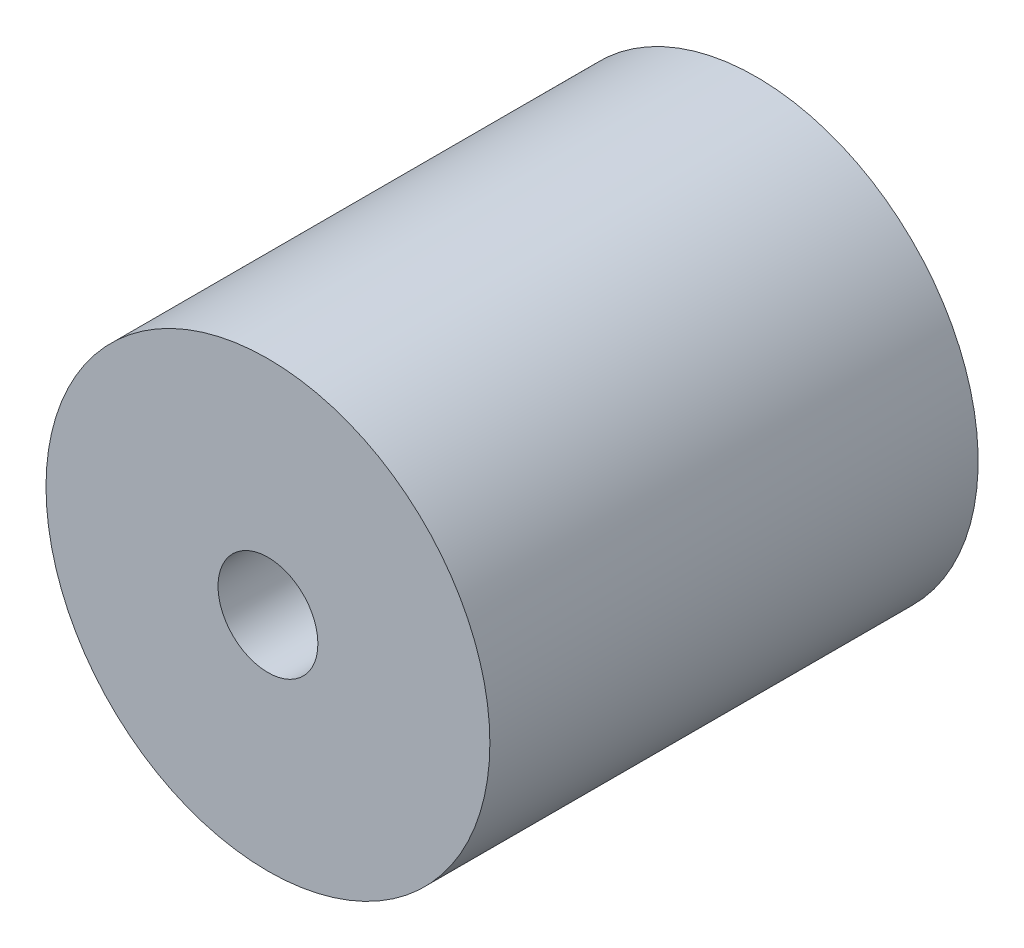
ISO-10303-21;
HEADER;
FILE_DESCRIPTION(('STEP AP214'),'2;1');
FILE_NAME('part.step','',(''),(''),'','','');
FILE_SCHEMA(('AUTOMOTIVE_DESIGN { 1 0 10303 214 1 1 1 1 }'));
ENDSEC;
DATA;
#1=APPLICATION_CONTEXT('core data for automotive mechanical design processes');
#2=APPLICATION_PROTOCOL_DEFINITION('international standard','automotive_design',2000,#1);
#3=PRODUCT_CONTEXT('',#1,'mechanical');
#4=PRODUCT('Part','Part','',(#3));
#5=PRODUCT_RELATED_PRODUCT_CATEGORY('part','',(#4));
#6=PRODUCT_DEFINITION_FORMATION('','',#4);
#7=PRODUCT_DEFINITION_CONTEXT('part definition',#1,'design');
#8=PRODUCT_DEFINITION('design','',#6,#7);
#9=PRODUCT_DEFINITION_SHAPE('','',#8);
#10=(LENGTH_UNIT() NAMED_UNIT(*) SI_UNIT(.MILLI.,.METRE.));
#11=(NAMED_UNIT(*) PLANE_ANGLE_UNIT() SI_UNIT($,.RADIAN.));
#12=(NAMED_UNIT(*) SI_UNIT($,.STERADIAN.) SOLID_ANGLE_UNIT());
#13=UNCERTAINTY_MEASURE_WITH_UNIT(LENGTH_MEASURE(1.E-05),#10,'distance_accuracy_value','');
#14=(GEOMETRIC_REPRESENTATION_CONTEXT(3) GLOBAL_UNCERTAINTY_ASSIGNED_CONTEXT((#13)) GLOBAL_UNIT_ASSIGNED_CONTEXT((#10,
#11,#12)) REPRESENTATION_CONTEXT('',''));
#15=CARTESIAN_POINT('',(0.,0.,0.));
#16=DIRECTION('',(0.,0.,1.));
#17=DIRECTION('',(1.,0.,0.));
#18=AXIS2_PLACEMENT_3D('',#15,#16,#17);
#19=CARTESIAN_POINT('',(0.,0.,0.));
#20=DIRECTION('',(0.,0.,1.));
#21=DIRECTION('',(1.,0.,0.));
#22=AXIS2_PLACEMENT_3D('',#19,#20,#21);
#23=PLANE('',#22);
#24=CARTESIAN_POINT('',(0.,0.,0.));
#25=DIRECTION('',(0.,0.,1.));
#26=DIRECTION('',(1.,0.,0.));
#27=AXIS2_PLACEMENT_3D('',#24,#25,#26);
#28=CIRCLE('',#27,2.25);
#29=CARTESIAN_POINT('',(2.25,0.,0.));
#30=VERTEX_POINT('',#29);
#31=EDGE_CURVE('E48',#30,#30,#28,.T.);
#32=ORIENTED_EDGE('',*,*,#31,.T.);
#33=EDGE_LOOP('',(#32));
#34=FACE_BOUND('',#33,.T.);
#35=CARTESIAN_POINT('',(0.,0.,0.));
#36=DIRECTION('',(0.,0.,-1.));
#37=DIRECTION('',(-1.,0.,0.));
#38=AXIS2_PLACEMENT_3D('',#35,#36,#37);
#39=CIRCLE('',#38,3.7);
#40=CARTESIAN_POINT('',(-3.7,0.,0.));
#41=VERTEX_POINT('',#40);
#42=EDGE_CURVE('E118',#41,#41,#39,.T.);
#43=ORIENTED_EDGE('',*,*,#42,.T.);
#44=EDGE_LOOP('',(#43));
#45=FACE_BOUND('',#44,.T.);
#46=ADVANCED_FACE('F31',(#34,#45),#23,.F.);
#47=CARTESIAN_POINT('',(0.,0.,15.));
#48=DIRECTION('',(0.,0.,1.));
#49=DIRECTION('',(1.,0.,0.));
#50=AXIS2_PLACEMENT_3D('',#47,#48,#49);
#51=PLANE('',#50);
#52=CARTESIAN_POINT('',(0.,0.,15.));
#53=DIRECTION('',(0.,0.,1.));
#54=DIRECTION('',(1.,0.,0.));
#55=AXIS2_PLACEMENT_3D('',#52,#53,#54);
#56=CIRCLE('',#55,10.);
#57=CARTESIAN_POINT('',(10.,0.,15.));
#58=VERTEX_POINT('',#57);
#59=EDGE_CURVE('E10',#58,#58,#56,.T.);
#60=ORIENTED_EDGE('',*,*,#59,.T.);
#61=EDGE_LOOP('',(#60));
#62=FACE_BOUND('',#61,.T.);
#63=CARTESIAN_POINT('',(0.,0.,15.));
#64=DIRECTION('',(0.,0.,1.));
#65=DIRECTION('',(1.,0.,0.));
#66=AXIS2_PLACEMENT_3D('',#63,#64,#65);
#67=CIRCLE('',#66,2.25);
#68=CARTESIAN_POINT('',(2.25,0.,15.));
#69=VERTEX_POINT('',#68);
#70=EDGE_CURVE('E44',#69,#69,#67,.T.);
#71=ORIENTED_EDGE('',*,*,#70,.F.);
#72=EDGE_LOOP('',(#71));
#73=FACE_BOUND('',#72,.T.);
#74=ADVANCED_FACE('F73',(#62,#73),#51,.T.);
#75=CARTESIAN_POINT('',(0.,0.,15.));
#76=DIRECTION('',(0.,0.,-1.));
#77=DIRECTION('',(-1.,0.,0.));
#78=AXIS2_PLACEMENT_3D('',#75,#76,#77);
#79=CYLINDRICAL_SURFACE('',#78,10.);
#80=CARTESIAN_POINT('',(-10.,0.,5.5));
#81=CARTESIAN_POINT('',(-9.99999795161742,0.111153813585267,5.50000408899669));
#82=CARTESIAN_POINT('',(-9.99812770356462,0.222359320403045,5.50929768593529));
#83=CARTESIAN_POINT('',(-9.99084731246463,0.441627015378039,5.54619700023049));
#84=CARTESIAN_POINT('',(-9.98543435720372,0.549686635082712,5.57381726560302));
#85=CARTESIAN_POINT('',(-9.97167298556573,0.759460610526626,5.64648254724158));
#86=CARTESIAN_POINT('',(-9.96332738153436,0.861180935866269,5.69151087368938));
#87=CARTESIAN_POINT('',(-9.94460796070629,1.05561597772845,5.79766449502259));
#88=CARTESIAN_POINT('',(-9.93423426471414,1.14833123015162,5.85878883121441));
#89=CARTESIAN_POINT('',(-9.9124433065994,1.32338695462973,5.99627698858287));
#90=CARTESIAN_POINT('',(-9.90101491008695,1.40558790231705,6.0728167107824));
#91=CARTESIAN_POINT('',(-9.87848360905177,1.55607351321606,6.23858483278341));
#92=CARTESIAN_POINT('',(-9.86738073000847,1.62435708954085,6.32781422267024));
#93=CARTESIAN_POINT('',(-9.8466488362523,1.74566350669524,6.51743238602375));
#94=CARTESIAN_POINT('',(-9.83703414729892,1.79854187773173,6.61791528759272));
#95=CARTESIAN_POINT('',(-9.82052536116836,1.88661133316062,6.82656363800816));
#96=CARTESIAN_POINT('',(-9.81363099523923,1.92180416487448,6.93472832669269));
#97=CARTESIAN_POINT('',(-9.80345610504409,1.97305059976966,7.15416872781583));
#98=CARTESIAN_POINT('',(-9.80012940214375,1.98934899591755,7.26538508828445));
#99=CARTESIAN_POINT('',(-9.79732750121254,2.00310425545224,7.48901964272869));
#100=CARTESIAN_POINT('',(-9.79785190935681,2.000563045427,7.60143771264029));
#101=CARTESIAN_POINT('',(-9.80265102296369,1.97690914620364,7.82249357604201));
#102=CARTESIAN_POINT('',(-9.80686905717527,1.95607708048781,7.93116281125463));
#103=CARTESIAN_POINT('',(-9.81849092320002,1.8968757692461,8.143432153326));
#104=CARTESIAN_POINT('',(-9.82589490715558,1.85850568620136,8.24703201783801));
#105=CARTESIAN_POINT('',(-9.84311237000816,1.76504956734944,8.4470305234072));
#106=CARTESIAN_POINT('',(-9.85294179627409,1.70985230246423,8.54337575913834));
#107=CARTESIAN_POINT('',(-9.87389237546124,1.58438714914536,8.72554169994562));
#108=CARTESIAN_POINT('',(-9.88501367676732,1.51411752871366,8.81136119370231));
#109=CARTESIAN_POINT('',(-9.90754042482924,1.35899986912117,8.97165880491387));
#110=CARTESIAN_POINT('',(-9.9189473842181,1.27391232242489,9.04590513571826));
#111=CARTESIAN_POINT('',(-9.94057697428817,1.09237004812402,9.17910769260245));
#112=CARTESIAN_POINT('',(-9.95079958977947,0.995915174758778,9.23806372258716));
#113=CARTESIAN_POINT('',(-9.96893380321774,0.794118773757841,9.33905501845195));
#114=CARTESIAN_POINT('',(-9.97684177696544,0.6887636391706,9.38106378728907));
#115=CARTESIAN_POINT('',(-9.98942817975716,0.472297952897329,9.44672094807713));
#116=CARTESIAN_POINT('',(-9.99410700001063,0.361188100144898,9.47037156414726));
#117=CARTESIAN_POINT('',(-9.99965343733736,0.1383588112543,9.49831290758855));
#118=CARTESIAN_POINT('',(-10.0005834930494,0.0266806566511518,9.50292083908054));
#119=CARTESIAN_POINT('',(-9.99870103860205,-0.195849868385429,9.49350028211564));
#120=CARTESIAN_POINT('',(-9.99588873882892,-0.306702284887587,9.47947284129481));
#121=CARTESIAN_POINT('',(-9.98687664016035,-0.523411319893082,9.43344325291209));
#122=CARTESIAN_POINT('',(-9.98070752808413,-0.629303896679806,9.40160386300419));
#123=CARTESIAN_POINT('',(-9.96567104122065,-0.834247254999335,9.32103203468838));
#124=CARTESIAN_POINT('',(-9.95680346428453,-0.933297523275079,9.27229833064634));
#125=CARTESIAN_POINT('',(-9.93719823066589,-1.12308234737244,9.15863501869737));
#126=CARTESIAN_POINT('',(-9.92643900874103,-1.21370025350438,9.09351443792211));
#127=CARTESIAN_POINT('',(-9.90429469659765,-1.38283603823841,8.94918161758544));
#128=CARTESIAN_POINT('',(-9.89290953936776,-1.46135261786153,8.86996786720027));
#129=CARTESIAN_POINT('',(-9.8705860711393,-1.60528118154835,8.69825329621775));
#130=CARTESIAN_POINT('',(-9.85965720466609,-1.67047540489731,8.60556851155732));
#131=CARTESIAN_POINT('',(-9.83968383592389,-1.78437084010241,8.41037727728664));
#132=CARTESIAN_POINT('',(-9.83063925826685,-1.83307271184581,8.3078712208529));
#133=CARTESIAN_POINT('',(-9.81553481168766,-1.91230368316392,8.0964635077009));
#134=CARTESIAN_POINT('',(-9.80945949744373,-1.9429269995821,7.98759831757936));
#135=CARTESIAN_POINT('',(-9.8009487358405,-1.98541730325439,7.76613309301819));
#136=CARTESIAN_POINT('',(-9.79851281382223,-1.99728673645022,7.65353354758131));
#137=CARTESIAN_POINT('',(-9.79758299262758,-2.00184182173494,7.42998227091136));
#138=CARTESIAN_POINT('',(-9.79901838378602,-1.99487157614179,7.31903770214598));
#139=CARTESIAN_POINT('',(-9.80551146969228,-1.96270460820012,7.09993670018995));
#140=CARTESIAN_POINT('',(-9.81056913534338,-1.9375080322586,6.99178024461039));
#141=CARTESIAN_POINT('',(-9.82370528438317,-1.86975713699791,6.78154457751891));
#142=CARTESIAN_POINT('',(-9.83177642037661,-1.82724501343469,6.67945127899517));
#143=CARTESIAN_POINT('',(-9.85003429948341,-1.72610928920321,6.48379255853112));
#144=CARTESIAN_POINT('',(-9.86022121997788,-1.66748433754976,6.39022785254972));
#145=CARTESIAN_POINT('',(-9.88177921046451,-1.53461182957283,6.21256885569937));
#146=CARTESIAN_POINT('',(-9.89316745819399,-1.46011577447036,6.12866246946481));
#147=CARTESIAN_POINT('',(-9.91572163743909,-1.29812873802628,5.97442758894166));
#148=CARTESIAN_POINT('',(-9.92688751726369,-1.21063477430667,5.90410221936546));
#149=CARTESIAN_POINT('',(-9.94787664775943,-1.02403525817649,5.77833071210711));
#150=CARTESIAN_POINT('',(-9.95768462438492,-0.924817768859669,5.72304799343995));
#151=CARTESIAN_POINT('',(-9.9747025017,-0.718332721881465,5.63002775480682));
#152=CARTESIAN_POINT('',(-9.98191474277232,-0.611072521726252,5.59227442093501));
#153=CARTESIAN_POINT('',(-9.99152745190741,-0.419642977847559,5.54269610391057));
#154=CARTESIAN_POINT('',(-9.99468606316904,-0.336563328027569,5.52671361258448));
#155=CARTESIAN_POINT('',(-9.99892308279786,-0.168999050420134,5.50536417528327));
#156=CARTESIAN_POINT('',(-10.0000015574631,-0.0845144674972381,5.49999689098046));
#157=CARTESIAN_POINT('',(-10.,0.,5.5));
#158=B_SPLINE_CURVE_WITH_KNOTS('',3,(#80,#81,#82,#83,#84,#85,#86,#87,#88,#89,#90,#91,#92,#93,
#94,#95,#96,#97,#98,#99,#100,#101,#102,#103,#104,#105,#106,#107,#108,#109,#110,#111,#112,#113,
#114,#115,#116,#117,#118,#119,#120,#121,#122,#123,#124,#125,#126,#127,#128,#129,#130,#131,#132,
#133,#134,#135,#136,#137,#138,#139,#140,#141,#142,#143,#144,#145,#146,#147,#148,#149,#150,#151,
#152,#153,#154,#155,#156,#157),.UNSPECIFIED.,.T.,.F.,(4,2,2,2,2,2,2,2,2,2,2,2,2,2,2,2,2,2,2,2,2,
2,2,2,2,2,2,2,2,2,2,2,2,2,2,2,2,2,4),(0.,0.333152261322517,0.666569301382646,0.999667470500684,
1.33274580446173,1.66986534022437,2.00701119349473,2.34722390011846,2.68740298730395,
3.02312370207175,3.3588100856245,3.68943454012557,4.02007478507459,4.35294980407185,
4.68586309499341,5.02476504982701,5.36367135079641,5.70310549708048,6.04249851396072,
6.3762147135253,6.70991215315735,7.04060907901447,7.37133078432045,7.70610132066717,
8.0409077669186,8.38081257158451,8.72070377446933,9.05880762065446,9.39686736660829,
9.72879445135403,10.0607188698522,10.3918392250622,10.7229873516373,11.0597615247829,
11.3966130906586,11.7369899335127,12.0770591103504,12.3303755057979,12.5836838274199),.UNSPECIFIED.);
#159=CARTESIAN_POINT('',(-10.,0.,5.5));
#160=VERTEX_POINT('',#159);
#161=EDGE_CURVE('E52',#160,#160,#158,.T.);
#162=ORIENTED_EDGE('',*,*,#161,.T.);
#163=EDGE_LOOP('',(#162));
#164=FACE_BOUND('',#163,.T.);
#165=ORIENTED_EDGE('',*,*,#59,.F.);
#166=EDGE_LOOP('',(#165));
#167=FACE_BOUND('',#166,.T.);
#168=CARTESIAN_POINT('',(0.,0.,-7.));
#169=DIRECTION('',(0.,0.,-1.));
#170=DIRECTION('',(-1.,0.,0.));
#171=AXIS2_PLACEMENT_3D('',#168,#169,#170);
#172=CIRCLE('',#171,10.);
#173=CARTESIAN_POINT('',(-10.,0.,-7.));
#174=VERTEX_POINT('',#173);
#175=EDGE_CURVE('E58',#174,#174,#172,.T.);
#176=ORIENTED_EDGE('',*,*,#175,.F.);
#177=EDGE_LOOP('',(#176));
#178=FACE_BOUND('',#177,.T.);
#179=ADVANCED_FACE('F33',(#164,#167,#178),#79,.T.);
#180=CARTESIAN_POINT('',(0.,0.,15.));
#181=DIRECTION('',(0.,0.,-1.));
#182=DIRECTION('',(-1.,0.,0.));
#183=AXIS2_PLACEMENT_3D('',#180,#181,#182);
#184=CYLINDRICAL_SURFACE('',#183,2.25);
#185=CARTESIAN_POINT('',(-2.25,0.,9.5));
#186=CARTESIAN_POINT('',(-2.24999288487791,-0.0929564077510689,9.49999277831509));
#187=CARTESIAN_POINT('',(-2.24418066685145,-0.186058867044923,9.49346015893786));
#188=CARTESIAN_POINT('',(-2.22142925128133,-0.369214274420424,9.46781134548147));
#189=CARTESIAN_POINT('',(-2.20446347068837,-0.459259395190819,9.44866508822459));
#190=CARTESIAN_POINT('',(-2.16095052332586,-0.633059704121676,9.39930052238622));
#191=CARTESIAN_POINT('',(-2.13446961895885,-0.716853667535439,9.36915876383074));
#192=CARTESIAN_POINT('',(-2.07370549509102,-0.877280019713738,9.29945647743389));
#193=CARTESIAN_POINT('',(-2.0394219833786,-0.953912140111977,9.25989559683908));
#194=CARTESIAN_POINT('',(-1.95018206547283,-1.12793372322791,9.15580731411652));
#195=CARTESIAN_POINT('',(-1.89239449632186,-1.22165621203014,9.08757647950067));
#196=CARTESIAN_POINT('',(-1.76960730080706,-1.39363403979301,8.93901519855731));
#197=CARTESIAN_POINT('',(-1.70458916535033,-1.47184818795925,8.85865350231019));
#198=CARTESIAN_POINT('',(-1.57010119716315,-1.61463934516039,8.68567391020875));
#199=CARTESIAN_POINT('',(-1.50056382238261,-1.67886658306412,8.59281925572912));
#200=CARTESIAN_POINT('',(-1.39832963566286,-1.76327556601988,8.44553763341672));
#201=CARTESIAN_POINT('',(-1.3646141152829,-1.78941260753386,8.39513915932779));
#202=CARTESIAN_POINT('',(-1.29891345399785,-1.8376552049024,8.29138955014736));
#203=CARTESIAN_POINT('',(-1.26692711459504,-1.85976357889674,8.23804051335468));
#204=CARTESIAN_POINT('',(-1.2058201439678,-1.89995996310727,8.12741886879684));
#205=CARTESIAN_POINT('',(-1.17673344103525,-1.91800292682899,8.0701106987423));
#206=CARTESIAN_POINT('',(-1.12416284952649,-1.94927987405275,7.95171304646739));
#207=CARTESIAN_POINT('',(-1.10067078767834,-1.96252088775658,7.89062924660474));
#208=CARTESIAN_POINT('',(-1.06568420541675,-1.98170478420423,7.77510106624779));
#209=CARTESIAN_POINT('',(-1.05285143823247,-1.98849014714572,7.72121855563792));
#210=CARTESIAN_POINT('',(-1.03542692942574,-1.99762242349138,7.61180792216231));
#211=CARTESIAN_POINT('',(-1.03081725203865,-1.99997899733671,7.55628364999813));
#212=CARTESIAN_POINT('',(-1.030736003921,-2.00002077413812,7.44507599056484));
#213=CARTESIAN_POINT('',(-1.03528895023537,-1.99769344405839,7.38939257557125));
#214=CARTESIAN_POINT('',(-1.05265713122518,-1.98859319063572,7.27967098588133));
#215=CARTESIAN_POINT('',(-1.06549005241878,-1.98181075035167,7.22563659296522));
#216=CARTESIAN_POINT('',(-1.10557002815524,-1.95983519929359,7.09304752289219));
#217=CARTESIAN_POINT('',(-1.13683578011167,-1.94211061545034,7.01617118170864));
#218=CARTESIAN_POINT('',(-1.2072077814615,-1.89917300250213,6.86823907875204));
#219=CARTESIAN_POINT('',(-1.24634680931227,-1.87392844723354,6.79720946103879));
#220=CARTESIAN_POINT('',(-1.32315682987049,-1.82034933674966,6.66903509858355));
#221=CARTESIAN_POINT('',(-1.3603780073911,-1.79281996177239,6.61127507360279));
#222=CARTESIAN_POINT('',(-1.43608163122486,-1.73277410047581,6.49923120786853));
#223=CARTESIAN_POINT('',(-1.47456490759713,-1.70025427813071,6.44494972712588));
#224=CARTESIAN_POINT('',(-1.55156809229512,-1.63028908076728,6.33976678277392));
#225=CARTESIAN_POINT('',(-1.59008794846107,-1.5928475763958,6.28886270986236));
#226=CARTESIAN_POINT('',(-1.66627404151497,-1.51297060780924,6.19044424898727));
#227=CARTESIAN_POINT('',(-1.70394015383689,-1.47053442036464,6.14293035352491));
#228=CARTESIAN_POINT('',(-1.80038969768935,-1.35275458401291,6.0232354171477));
#229=CARTESIAN_POINT('',(-1.85784198745883,-1.27327849008184,5.95395149213963));
#230=CARTESIAN_POINT('',(-1.96482800974663,-1.1009991228619,5.82691726387959));
#231=CARTESIAN_POINT('',(-2.01437687041642,-1.00822197219427,5.76914487195346));
#232=CARTESIAN_POINT('',(-2.09270715251293,-0.83090201485056,5.67864887895375));
#233=CARTESIAN_POINT('',(-2.12366463645309,-0.748717201642339,5.64321290434431));
#234=CARTESIAN_POINT('',(-2.17641185045676,-0.577684784091015,5.58310748643529));
#235=CARTESIAN_POINT('',(-2.1982069221479,-0.488841097528313,5.55843176966054));
#236=CARTESIAN_POINT('',(-2.23103468005404,-0.306029366345685,5.52134104554406));
#237=CARTESIAN_POINT('',(-2.24199711943686,-0.212031993580783,5.50900605832064));
#238=CARTESIAN_POINT('',(-2.25188098364382,-0.0226158409483551,5.49788232234283));
#239=CARTESIAN_POINT('',(-2.25080744763877,0.0728023273572346,5.49908790448104));
#240=CARTESIAN_POINT('',(-2.23748517569486,0.251730898445847,5.51408739445345));
#241=CARTESIAN_POINT('',(-2.22641035448673,0.335447608417155,5.52655898383085));
#242=CARTESIAN_POINT('',(-2.19553058252894,0.499081211447596,5.56146432269695));
#243=CARTESIAN_POINT('',(-2.1757239542909,0.578997371104031,5.58389998641398));
#244=CARTESIAN_POINT('',(-2.1275898517752,0.736868716034051,5.6387318716007));
#245=CARTESIAN_POINT('',(-2.09892392565684,0.814580397649816,5.67152513769358));
#246=CARTESIAN_POINT('',(-2.03505756028891,0.963113918504795,5.74520778782528));
#247=CARTESIAN_POINT('',(-1.99985486460755,1.03393336570417,5.78609996785914));
#248=CARTESIAN_POINT('',(-1.90523967675118,1.20253143082003,5.89728852338397));
#249=CARTESIAN_POINT('',(-1.84263415473347,1.29564781783279,5.97194735453599));
#250=CARTESIAN_POINT('',(-1.71081449421082,1.46533078133777,6.13374829260006));
#251=CARTESIAN_POINT('',(-1.6415768789131,1.54183517973405,6.22093533644421));
#252=CARTESIAN_POINT('',(-1.53590283541785,1.64499481990196,6.36094621955353));
#253=CARTESIAN_POINT('',(-1.4999550186977,1.67775234093158,6.40976592047147));
#254=CARTESIAN_POINT('',(-1.42848782179923,1.7390038000827,6.51038372957949));
#255=CARTESIAN_POINT('',(-1.39296868491817,1.76749541289559,6.56218344100722));
#256=CARTESIAN_POINT('',(-1.32357121250827,1.82004009425395,6.66875211262724));
#257=CARTESIAN_POINT('',(-1.28968774713734,1.84410780841674,6.72351046933663));
#258=CARTESIAN_POINT('',(-1.22499001031204,1.88770084032142,6.83648806811602));
#259=CARTESIAN_POINT('',(-1.19417176275324,1.90723208775207,6.89470266599684));
#260=CARTESIAN_POINT('',(-1.14088746934915,1.93952111240352,7.00869573161712));
#261=CARTESIAN_POINT('',(-1.11788124480627,1.95277905417537,7.06407214729879));
#262=CARTESIAN_POINT('',(-1.07859220666631,1.97475253230857,7.17797291184629));
#263=CARTESIAN_POINT('',(-1.06229228153227,1.98347964446614,7.23648881291393));
#264=CARTESIAN_POINT('',(-1.03897445420617,1.99580152000251,7.35691357450104));
#265=CARTESIAN_POINT('',(-1.03209767348766,1.99931831520719,7.41885986361775));
#266=CARTESIAN_POINT('',(-1.02980777197403,2.00049992215466,7.5430078565651));
#267=CARTESIAN_POINT('',(-1.03438961986953,1.99816730228535,7.60520943632795));
#268=CARTESIAN_POINT('',(-1.054518732642,1.98761499119539,7.73177907105725));
#269=CARTESIAN_POINT('',(-1.07082864625639,1.97898519779559,7.79598270187735));
#270=CARTESIAN_POINT('',(-1.11176862951427,1.95627452108634,7.92076770815967));
#271=CARTESIAN_POINT('',(-1.13643190606996,1.942171848439,7.98133347274268));
#272=CARTESIAN_POINT('',(-1.18787056135685,1.91109037819585,8.09217289269261));
#273=CARTESIAN_POINT('',(-1.21411015151071,1.89460258510126,8.14284378773012));
#274=CARTESIAN_POINT('',(-1.26912991923373,1.85819887185624,8.24152654787572));
#275=CARTESIAN_POINT('',(-1.29791212805657,1.83828019854805,8.28953623624474));
#276=CARTESIAN_POINT('',(-1.38642509305412,1.77359465143897,8.43007280445052));
#277=CARTESIAN_POINT('',(-1.44828250637461,1.72392060586779,8.51903042022507));
#278=CARTESIAN_POINT('',(-1.5782862464467,1.60623869551184,8.69685297264138));
#279=CARTESIAN_POINT('',(-1.64644308415191,1.53689445692618,8.78481963495901));
#280=CARTESIAN_POINT('',(-1.77807708258508,1.38246535037721,8.94965260925683));
#281=CARTESIAN_POINT('',(-1.84156205208519,1.29740762257988,9.0265376597527));
#282=CARTESIAN_POINT('',(-1.94813101466738,1.12925070090156,9.15337339676974));
#283=CARTESIAN_POINT('',(-1.99279007154707,1.04892342866983,9.20566013421367));
#284=CARTESIAN_POINT('',(-2.07366112774334,0.878244101653333,9.29948256647131));
#285=CARTESIAN_POINT('',(-2.10987903066948,0.787899118753134,9.34102577737981));
#286=CARTESIAN_POINT('',(-2.16645327488907,0.613247441791722,9.40557609605535));
#287=CARTESIAN_POINT('',(-2.18839183610421,0.530146477750004,9.43045067505753));
#288=CARTESIAN_POINT('',(-2.22276125861824,0.359644844419738,9.46932773066944));
#289=CARTESIAN_POINT('',(-2.23521650228416,0.272255820785648,9.4833580900506));
#290=CARTESIAN_POINT('',(-2.24496923230047,0.153489853598623,9.49433891058869));
#291=CARTESIAN_POINT('',(-2.24685241140575,0.122867602955443,9.49645842132035));
#292=CARTESIAN_POINT('',(-2.24936908658772,0.0615022461490164,9.49929028937166));
#293=CARTESIAN_POINT('',(-2.25000235438193,0.030759118936165,9.50000238964339));
#294=CARTESIAN_POINT('',(-2.25,0.,9.5));
#295=B_SPLINE_CURVE_WITH_KNOTS('',3,(#185,#186,#187,#188,#189,#190,#191,#192,#193,#194,#195,
#196,#197,#198,#199,#200,#201,#202,#203,#204,#205,#206,#207,#208,#209,#210,#211,#212,#213,#214,
#215,#216,#217,#218,#219,#220,#221,#222,#223,#224,#225,#226,#227,#228,#229,#230,#231,#232,#233,
#234,#235,#236,#237,#238,#239,#240,#241,#242,#243,#244,#245,#246,#247,#248,#249,#250,#251,#252,
#253,#254,#255,#256,#257,#258,#259,#260,#261,#262,#263,#264,#265,#266,#267,#268,#269,#270,#271,
#272,#273,#274,#275,#276,#277,#278,#279,#280,#281,#282,#283,#284,#285,#286,#287,#288,#289,#290,
#291,#292,#293,#294),.UNSPECIFIED.,.T.,.F.,(4,2,2,2,2,2,2,2,2,2,2,2,2,2,2,2,2,2,2,2,2,2,2,2,2,2,
2,2,2,2,2,2,2,2,2,2,2,2,2,2,2,2,2,2,2,2,2,2,2,2,2,2,2,2,4),(0.,0.278730900052643,
0.558128538729299,0.835617034538774,1.11311592414313,1.49959348954051,1.88708419559665,
2.28336880128521,2.48130251908775,2.67909724197132,2.87898623331897,3.07858138827361,
3.24532666112031,3.4117077913163,3.57853471055127,3.74571916706282,3.99886924663909,
4.25309591859229,4.47488672226673,4.69682644026882,4.91859264699085,5.14039100503177,
5.49922632365978,5.85736632344889,6.14034666595754,6.42316180318119,6.7077991188493,
6.99231726823287,7.2472434689953,7.50221866559711,7.76848356096435,8.03484053992675,
8.43698820370536,8.84061609227075,9.0471915651425,9.25387923370104,9.4598698148313,
9.66558960775169,9.84937516610855,10.0326888317364,10.2187188661458,10.4046672319419,
10.6039477910003,10.8040300288029,10.9819699543434,11.1600533412305,11.5164851913896,
11.9085488697184,12.2999416058179,12.6160291454678,12.9318949506319,13.1992189671477,
13.4658533294425,13.5580680748913,13.6502996607854),.UNSPECIFIED.);
#296=CARTESIAN_POINT('',(-2.25,0.,9.5));
#297=VERTEX_POINT('',#296);
#298=EDGE_CURVE('E36',#297,#297,#295,.T.);
#299=ORIENTED_EDGE('',*,*,#298,.F.);
#300=EDGE_LOOP('',(#299));
#301=FACE_BOUND('',#300,.T.);
#302=ORIENTED_EDGE('',*,*,#70,.T.);
#303=EDGE_LOOP('',(#302));
#304=FACE_BOUND('',#303,.T.);
#305=ORIENTED_EDGE('',*,*,#31,.F.);
#306=EDGE_LOOP('',(#305));
#307=FACE_BOUND('',#306,.T.);
#308=ADVANCED_FACE('F65',(#301,#304,#307),#184,.F.);
#309=CARTESIAN_POINT('',(-10.,0.,7.5));
#310=DIRECTION('',(1.,0.,0.));
#311=DIRECTION('',(0.,0.,-1.));
#312=AXIS2_PLACEMENT_3D('',#309,#310,#311);
#313=CYLINDRICAL_SURFACE('',#312,2.);
#314=ORIENTED_EDGE('',*,*,#298,.T.);
#315=EDGE_LOOP('',(#314));
#316=FACE_BOUND('',#315,.T.);
#317=ORIENTED_EDGE('',*,*,#161,.F.);
#318=EDGE_LOOP('',(#317));
#319=FACE_BOUND('',#318,.T.);
#320=ADVANCED_FACE('F60',(#316,#319),#313,.F.);
#321=CARTESIAN_POINT('',(0.,0.,-7.));
#322=DIRECTION('',(0.,0.,-1.));
#323=DIRECTION('',(-1.,0.,0.));
#324=AXIS2_PLACEMENT_3D('',#321,#322,#323);
#325=PLANE('',#324);
#326=CARTESIAN_POINT('',(-4.01849275456948E-13,-7.1,-7.));
#327=DIRECTION('',(0.,0.,-1.));
#328=DIRECTION('',(-1.,0.,0.));
#329=AXIS2_PLACEMENT_3D('',#326,#327,#328);
#330=CIRCLE('',#329,0.547725274292284);
#331=CARTESIAN_POINT('',(-0.547725274292686,-7.1,-7.));
#332=VERTEX_POINT('',#331);
#333=EDGE_CURVE('E109',#332,#332,#330,.T.);
#334=ORIENTED_EDGE('',*,*,#333,.F.);
#335=EDGE_LOOP('',(#334));
#336=FACE_BOUND('',#335,.T.);
#337=CARTESIAN_POINT('',(0.,0.,-7.));
#338=DIRECTION('',(0.,0.,-1.));
#339=DIRECTION('',(-1.,0.,0.));
#340=AXIS2_PLACEMENT_3D('',#337,#338,#339);
#341=CIRCLE('',#340,3.7);
#342=CARTESIAN_POINT('',(-3.7,0.,-7.));
#343=VERTEX_POINT('',#342);
#344=EDGE_CURVE('E121',#343,#343,#341,.T.);
#345=ORIENTED_EDGE('',*,*,#344,.F.);
#346=EDGE_LOOP('',(#345));
#347=FACE_BOUND('',#346,.T.);
#348=ORIENTED_EDGE('',*,*,#175,.T.);
#349=EDGE_LOOP('',(#348));
#350=FACE_BOUND('',#349,.T.);
#351=CARTESIAN_POINT('',(0.,7.1,-7.));
#352=DIRECTION('',(0.,0.,-1.));
#353=DIRECTION('',(-1.,0.,0.));
#354=AXIS2_PLACEMENT_3D('',#351,#352,#353);
#355=CIRCLE('',#354,0.547725274291852);
#356=CARTESIAN_POINT('',(-0.547725274291852,7.1,-7.));
#357=VERTEX_POINT('',#356);
#358=EDGE_CURVE('E127',#357,#357,#355,.T.);
#359=ORIENTED_EDGE('',*,*,#358,.F.);
#360=EDGE_LOOP('',(#359));
#361=FACE_BOUND('',#360,.T.);
#362=CARTESIAN_POINT('',(-7.1000000000002,2.00924637728474E-13,-7.));
#363=DIRECTION('',(0.,0.,-1.));
#364=DIRECTION('',(-1.,0.,0.));
#365=AXIS2_PLACEMENT_3D('',#362,#363,#364);
#366=CIRCLE('',#365,0.547725274292009);
#367=CARTESIAN_POINT('',(-7.64772527429221,2.00924637728474E-13,-7.));
#368=VERTEX_POINT('',#367);
#369=EDGE_CURVE('E115',#368,#368,#366,.T.);
#370=ORIENTED_EDGE('',*,*,#369,.F.);
#371=EDGE_LOOP('',(#370));
#372=FACE_BOUND('',#371,.T.);
#373=CARTESIAN_POINT('',(7.0999999999998,-2.01794136955868E-13,-7.));
#374=DIRECTION('',(0.,0.,-1.));
#375=DIRECTION('',(-1.,0.,0.));
#376=AXIS2_PLACEMENT_3D('',#373,#374,#375);
#377=CIRCLE('',#376,0.547725274292175);
#378=CARTESIAN_POINT('',(6.55227472570762,-2.01794136955868E-13,-7.));
#379=VERTEX_POINT('',#378);
#380=EDGE_CURVE('E103',#379,#379,#377,.T.);
#381=ORIENTED_EDGE('',*,*,#380,.F.);
#382=EDGE_LOOP('',(#381));
#383=FACE_BOUND('',#382,.T.);
#384=ADVANCED_FACE('F64',(#336,#347,#350,#361,#372,#383),#325,.T.);
#385=CARTESIAN_POINT('',(0.,7.1,-7.));
#386=DIRECTION('',(0.,0.,1.));
#387=DIRECTION('',(1.,0.,0.));
#388=AXIS2_PLACEMENT_3D('',#385,#386,#387);
#389=CYLINDRICAL_SURFACE('',#388,0.547725274291852);
#390=ORIENTED_EDGE('',*,*,#358,.T.);
#391=EDGE_LOOP('',(#390));
#392=FACE_BOUND('',#391,.T.);
#393=CARTESIAN_POINT('',(0.,7.1,0.));
#394=DIRECTION('',(0.,0.,-1.));
#395=DIRECTION('',(-1.,0.,0.));
#396=AXIS2_PLACEMENT_3D('',#393,#394,#395);
#397=CIRCLE('',#396,0.547725274291852);
#398=CARTESIAN_POINT('',(-0.547725274291852,7.1,0.));
#399=VERTEX_POINT('',#398);
#400=EDGE_CURVE('E124',#399,#399,#397,.T.);
#401=ORIENTED_EDGE('',*,*,#400,.F.);
#402=EDGE_LOOP('',(#401));
#403=FACE_BOUND('',#402,.T.);
#404=ADVANCED_FACE('F131',(#392,#403),#389,.F.);
#405=CARTESIAN_POINT('',(0.,0.,-7.));
#406=DIRECTION('',(0.,0.,1.));
#407=DIRECTION('',(1.,0.,0.));
#408=AXIS2_PLACEMENT_3D('',#405,#406,#407);
#409=CYLINDRICAL_SURFACE('',#408,3.7);
#410=ORIENTED_EDGE('',*,*,#344,.T.);
#411=EDGE_LOOP('',(#410));
#412=FACE_BOUND('',#411,.T.);
#413=ORIENTED_EDGE('',*,*,#42,.F.);
#414=EDGE_LOOP('',(#413));
#415=FACE_BOUND('',#414,.T.);
#416=ADVANCED_FACE('F133',(#412,#415),#409,.F.);
#417=CARTESIAN_POINT('',(-7.1000000000002,2.00924637728474E-13,-7.));
#418=DIRECTION('',(0.,0.,1.));
#419=DIRECTION('',(1.,0.,0.));
#420=AXIS2_PLACEMENT_3D('',#417,#418,#419);
#421=CYLINDRICAL_SURFACE('',#420,0.547725274292009);
#422=ORIENTED_EDGE('',*,*,#369,.T.);
#423=EDGE_LOOP('',(#422));
#424=FACE_BOUND('',#423,.T.);
#425=CARTESIAN_POINT('',(-7.1000000000002,2.00924637728474E-13,0.));
#426=DIRECTION('',(0.,0.,-1.));
#427=DIRECTION('',(-1.,0.,0.));
#428=AXIS2_PLACEMENT_3D('',#425,#426,#427);
#429=CIRCLE('',#428,0.547725274292009);
#430=CARTESIAN_POINT('',(-7.64772527429221,2.00924637728474E-13,0.));
#431=VERTEX_POINT('',#430);
#432=EDGE_CURVE('E112',#431,#431,#429,.T.);
#433=ORIENTED_EDGE('',*,*,#432,.F.);
#434=EDGE_LOOP('',(#433));
#435=FACE_BOUND('',#434,.T.);
#436=ADVANCED_FACE('F139',(#424,#435),#421,.F.);
#437=CARTESIAN_POINT('',(-4.01849275456948E-13,-7.1,-7.));
#438=DIRECTION('',(0.,0.,1.));
#439=DIRECTION('',(1.,0.,0.));
#440=AXIS2_PLACEMENT_3D('',#437,#438,#439);
#441=CYLINDRICAL_SURFACE('',#440,0.547725274292284);
#442=ORIENTED_EDGE('',*,*,#333,.T.);
#443=EDGE_LOOP('',(#442));
#444=FACE_BOUND('',#443,.T.);
#445=CARTESIAN_POINT('',(-4.01849275456948E-13,-7.1,0.));
#446=DIRECTION('',(0.,0.,-1.));
#447=DIRECTION('',(-1.,0.,0.));
#448=AXIS2_PLACEMENT_3D('',#445,#446,#447);
#449=CIRCLE('',#448,0.547725274292284);
#450=CARTESIAN_POINT('',(-0.547725274292686,-7.1,0.));
#451=VERTEX_POINT('',#450);
#452=EDGE_CURVE('E106',#451,#451,#449,.T.);
#453=ORIENTED_EDGE('',*,*,#452,.F.);
#454=EDGE_LOOP('',(#453));
#455=FACE_BOUND('',#454,.T.);
#456=ADVANCED_FACE('F96',(#444,#455),#441,.F.);
#457=CARTESIAN_POINT('',(7.0999999999998,-2.01794136955868E-13,-7.));
#458=DIRECTION('',(0.,0.,1.));
#459=DIRECTION('',(1.,0.,0.));
#460=AXIS2_PLACEMENT_3D('',#457,#458,#459);
#461=CYLINDRICAL_SURFACE('',#460,0.547725274292175);
#462=ORIENTED_EDGE('',*,*,#380,.T.);
#463=EDGE_LOOP('',(#462));
#464=FACE_BOUND('',#463,.T.);
#465=CARTESIAN_POINT('',(7.0999999999998,-2.01794136955868E-13,0.));
#466=DIRECTION('',(0.,0.,-1.));
#467=DIRECTION('',(-1.,0.,0.));
#468=AXIS2_PLACEMENT_3D('',#465,#466,#467);
#469=CIRCLE('',#468,0.547725274292175);
#470=CARTESIAN_POINT('',(6.55227472570762,-2.01794136955868E-13,0.));
#471=VERTEX_POINT('',#470);
#472=EDGE_CURVE('E101',#471,#471,#469,.T.);
#473=ORIENTED_EDGE('',*,*,#472,.F.);
#474=EDGE_LOOP('',(#473));
#475=FACE_BOUND('',#474,.T.);
#476=ADVANCED_FACE('F89',(#464,#475),#461,.F.);
#477=ORIENTED_EDGE('',*,*,#472,.T.);
#478=EDGE_LOOP('',(#477));
#479=FACE_BOUND('',#478,.T.);
#480=ADVANCED_FACE('F79',(#479),#23,.F.);
#481=ORIENTED_EDGE('',*,*,#452,.T.);
#482=EDGE_LOOP('',(#481));
#483=FACE_BOUND('',#482,.T.);
#484=ADVANCED_FACE('F83',(#483),#23,.F.);
#485=ORIENTED_EDGE('',*,*,#432,.T.);
#486=EDGE_LOOP('',(#485));
#487=FACE_BOUND('',#486,.T.);
#488=ADVANCED_FACE('F77',(#487),#23,.F.);
#489=ORIENTED_EDGE('',*,*,#400,.T.);
#490=EDGE_LOOP('',(#489));
#491=FACE_BOUND('',#490,.T.);
#492=ADVANCED_FACE('F75',(#491),#23,.F.);
#493=CLOSED_SHELL('',(#46,#74,#179,#308,#320,#384,#404,#416,#436,#456,#476,#480,#484,#488,#492));
#494=MANIFOLD_SOLID_BREP('B2',#493);
#495=ADVANCED_BREP_SHAPE_REPRESENTATION('',(#18,#494),#14);
#496=SHAPE_DEFINITION_REPRESENTATION(#9,#495);
ENDSEC;
END-ISO-10303-21;
